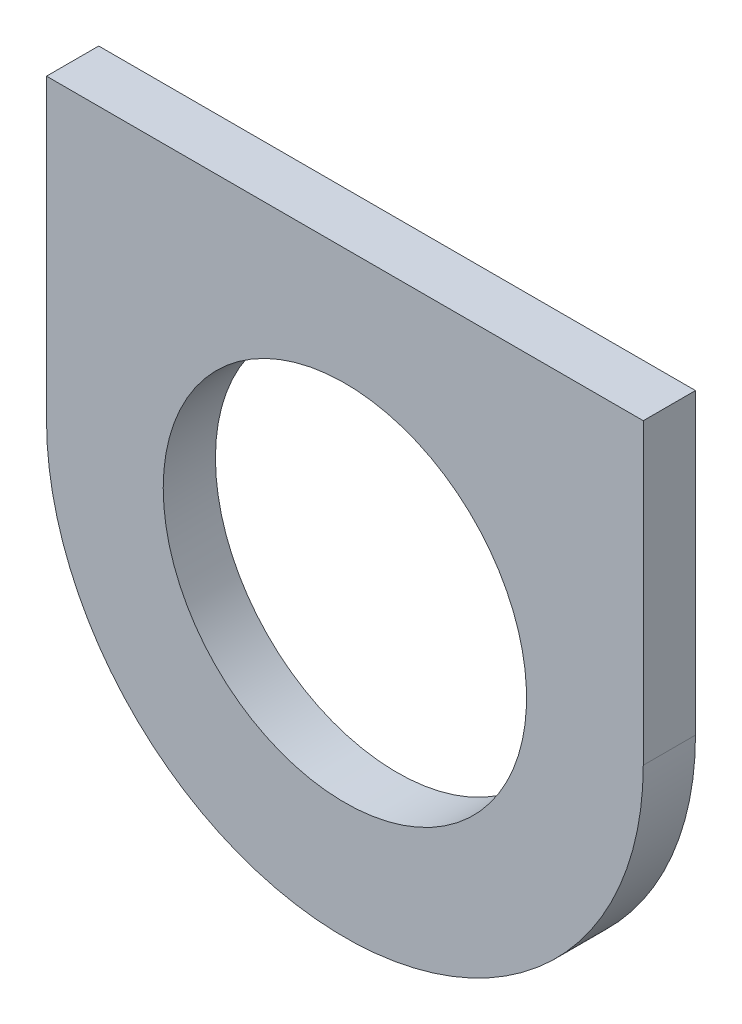
ISO-10303-21;
HEADER;
FILE_DESCRIPTION(('STEP AP214'),'2;1');
FILE_NAME('part.step','',(''),(''),'','','');
FILE_SCHEMA(('AUTOMOTIVE_DESIGN { 1 0 10303 214 1 1 1 1 }'));
ENDSEC;
DATA;
#1=APPLICATION_CONTEXT('core data for automotive mechanical design processes');
#2=APPLICATION_PROTOCOL_DEFINITION('international standard','automotive_design',2000,#1);
#3=PRODUCT_CONTEXT('',#1,'mechanical');
#4=PRODUCT('Part','Part','',(#3));
#5=PRODUCT_RELATED_PRODUCT_CATEGORY('part','',(#4));
#6=PRODUCT_DEFINITION_FORMATION('','',#4);
#7=PRODUCT_DEFINITION_CONTEXT('part definition',#1,'design');
#8=PRODUCT_DEFINITION('design','',#6,#7);
#9=PRODUCT_DEFINITION_SHAPE('','',#8);
#10=(LENGTH_UNIT() NAMED_UNIT(*) SI_UNIT(.MILLI.,.METRE.));
#11=(NAMED_UNIT(*) PLANE_ANGLE_UNIT() SI_UNIT($,.RADIAN.));
#12=(NAMED_UNIT(*) SI_UNIT($,.STERADIAN.) SOLID_ANGLE_UNIT());
#13=UNCERTAINTY_MEASURE_WITH_UNIT(LENGTH_MEASURE(1.E-05),#10,'distance_accuracy_value','');
#14=(GEOMETRIC_REPRESENTATION_CONTEXT(3) GLOBAL_UNCERTAINTY_ASSIGNED_CONTEXT((#13)) GLOBAL_UNIT_ASSIGNED_CONTEXT((#10,
#11,#12)) REPRESENTATION_CONTEXT('',''));
#15=CARTESIAN_POINT('',(0.,0.,0.));
#16=DIRECTION('',(0.,0.,1.));
#17=DIRECTION('',(1.,0.,0.));
#18=AXIS2_PLACEMENT_3D('',#15,#16,#17);
#19=CARTESIAN_POINT('',(-111.06193771337,637.468625118651,763.667404568447));
#20=DIRECTION('',(0.,0.,-1.));
#21=DIRECTION('',(-1.,0.,0.));
#22=AXIS2_PLACEMENT_3D('',#19,#20,#21);
#23=PLANE('',#22);
#24=CARTESIAN_POINT('',(-111.06193771337,637.468625118651,763.667404568447));
#25=DIRECTION('',(0.,0.,-1.));
#26=DIRECTION('',(-1.,0.,0.));
#27=AXIS2_PLACEMENT_3D('',#24,#25,#26);
#28=CIRCLE('',#27,2.85749999999998);
#29=CARTESIAN_POINT('',(-108.20443771337,637.468625118651,763.667404568447));
#30=VERTEX_POINT('',#29);
#31=CARTESIAN_POINT('',(-113.91943771337,637.468625118651,763.667404568447));
#32=VERTEX_POINT('',#31);
#33=EDGE_CURVE('E86',#30,#32,#28,.T.);
#34=ORIENTED_EDGE('',*,*,#33,.T.);
#35=DIRECTION('',(0.,1.,0.));
#36=VECTOR('',#35,1.);
#37=CARTESIAN_POINT('',(-113.91943771337,637.468625118651,763.667404568447));
#38=LINE('',#37,#36);
#39=CARTESIAN_POINT('',(-113.91943771337,640.326125118651,763.667404568447));
#40=VERTEX_POINT('',#39);
#41=EDGE_CURVE('E81',#32,#40,#38,.T.);
#42=ORIENTED_EDGE('',*,*,#41,.T.);
#43=DIRECTION('',(1.,0.,0.));
#44=VECTOR('',#43,1.);
#45=CARTESIAN_POINT('',(-111.06193771337,640.326125118651,763.667404568447));
#46=LINE('',#45,#44);
#47=CARTESIAN_POINT('',(-108.20443771337,640.326125118651,763.667404568447));
#48=VERTEX_POINT('',#47);
#49=EDGE_CURVE('E84',#40,#48,#46,.T.);
#50=ORIENTED_EDGE('',*,*,#49,.T.);
#51=DIRECTION('',(0.,-1.,0.));
#52=VECTOR('',#51,1.);
#53=CARTESIAN_POINT('',(-108.20443771337,637.468625118651,763.667404568447));
#54=LINE('',#53,#52);
#55=EDGE_CURVE('E52',#48,#30,#54,.T.);
#56=ORIENTED_EDGE('',*,*,#55,.T.);
#57=EDGE_LOOP('',(#34,#42,#50,#56));
#58=FACE_BOUND('',#57,.T.);
#59=CARTESIAN_POINT('',(-111.06193771337,637.468625118651,763.667404568447));
#60=DIRECTION('',(0.,0.,-1.));
#61=DIRECTION('',(-1.,0.,0.));
#62=AXIS2_PLACEMENT_3D('',#59,#60,#61);
#63=CIRCLE('',#62,1.73990000000006);
#64=CARTESIAN_POINT('',(-112.80183771337,637.468625118651,763.667404568447));
#65=VERTEX_POINT('',#64);
#66=EDGE_CURVE('E102',#65,#65,#63,.T.);
#67=ORIENTED_EDGE('',*,*,#66,.F.);
#68=EDGE_LOOP('',(#67));
#69=FACE_BOUND('',#68,.T.);
#70=ADVANCED_FACE('F35',(#58,#69),#23,.T.);
#71=CARTESIAN_POINT('',(-111.06193771337,637.468625118651,764.167404568447));
#72=DIRECTION('',(0.,0.,-1.));
#73=DIRECTION('',(-1.,0.,0.));
#74=AXIS2_PLACEMENT_3D('',#71,#72,#73);
#75=PLANE('',#74);
#76=CARTESIAN_POINT('',(-111.06193771337,637.468625118651,764.167404568447));
#77=DIRECTION('',(0.,0.,-1.));
#78=DIRECTION('',(-1.,0.,0.));
#79=AXIS2_PLACEMENT_3D('',#76,#77,#78);
#80=CIRCLE('',#79,2.85749999999998);
#81=CARTESIAN_POINT('',(-108.20443771337,637.468625118651,764.167404568447));
#82=VERTEX_POINT('',#81);
#83=CARTESIAN_POINT('',(-113.91943771337,637.468625118651,764.167404568447));
#84=VERTEX_POINT('',#83);
#85=EDGE_CURVE('E99',#82,#84,#80,.T.);
#86=ORIENTED_EDGE('',*,*,#85,.F.);
#87=DIRECTION('',(0.,-1.,0.));
#88=VECTOR('',#87,1.);
#89=CARTESIAN_POINT('',(-108.20443771337,637.468625118651,764.167404568447));
#90=LINE('',#89,#88);
#91=CARTESIAN_POINT('',(-108.20443771337,640.326125118651,764.167404568447));
#92=VERTEX_POINT('',#91);
#93=EDGE_CURVE('E74',#92,#82,#90,.T.);
#94=ORIENTED_EDGE('',*,*,#93,.F.);
#95=DIRECTION('',(1.,0.,0.));
#96=VECTOR('',#95,1.);
#97=CARTESIAN_POINT('',(-111.06193771337,640.326125118651,764.167404568447));
#98=LINE('',#97,#96);
#99=CARTESIAN_POINT('',(-113.91943771337,640.326125118651,764.167404568447));
#100=VERTEX_POINT('',#99);
#101=EDGE_CURVE('E68',#100,#92,#98,.T.);
#102=ORIENTED_EDGE('',*,*,#101,.F.);
#103=DIRECTION('',(0.,1.,0.));
#104=VECTOR('',#103,1.);
#105=CARTESIAN_POINT('',(-113.91943771337,637.468625118651,764.167404568447));
#106=LINE('',#105,#104);
#107=EDGE_CURVE('E91',#84,#100,#106,.T.);
#108=ORIENTED_EDGE('',*,*,#107,.F.);
#109=EDGE_LOOP('',(#86,#94,#102,#108));
#110=FACE_BOUND('',#109,.T.);
#111=CARTESIAN_POINT('',(-111.06193771337,637.468625118651,764.167404568447));
#112=DIRECTION('',(0.,0.,-1.));
#113=DIRECTION('',(-1.,0.,0.));
#114=AXIS2_PLACEMENT_3D('',#111,#112,#113);
#115=CIRCLE('',#114,1.73990000000006);
#116=CARTESIAN_POINT('',(-112.80183771337,637.468625118651,764.167404568447));
#117=VERTEX_POINT('',#116);
#118=EDGE_CURVE('E114',#117,#117,#115,.T.);
#119=ORIENTED_EDGE('',*,*,#118,.T.);
#120=EDGE_LOOP('',(#119));
#121=FACE_BOUND('',#120,.T.);
#122=ADVANCED_FACE('F110',(#110,#121),#75,.F.);
#123=CARTESIAN_POINT('',(-111.06193771337,637.468625118651,763.667404568447));
#124=DIRECTION('',(0.,0.,1.));
#125=DIRECTION('',(1.,0.,0.));
#126=AXIS2_PLACEMENT_3D('',#123,#124,#125);
#127=CYLINDRICAL_SURFACE('',#126,2.85749999999998);
#128=ORIENTED_EDGE('',*,*,#85,.T.);
#129=DIRECTION('',(0.,0.,1.));
#130=VECTOR('',#129,1.);
#131=CARTESIAN_POINT('',(-113.91943771337,637.468625118651,763.667404568447));
#132=LINE('',#131,#130);
#133=EDGE_CURVE('E11',#32,#84,#132,.T.);
#134=ORIENTED_EDGE('',*,*,#133,.F.);
#135=ORIENTED_EDGE('',*,*,#33,.F.);
#136=DIRECTION('',(0.,0.,1.));
#137=VECTOR('',#136,1.);
#138=CARTESIAN_POINT('',(-108.20443771337,637.468625118651,763.667404568447));
#139=LINE('',#138,#137);
#140=EDGE_CURVE('E95',#30,#82,#139,.T.);
#141=ORIENTED_EDGE('',*,*,#140,.T.);
#142=EDGE_LOOP('',(#128,#134,#135,#141));
#143=FACE_BOUND('',#142,.T.);
#144=ADVANCED_FACE('F37',(#143),#127,.T.);
#145=CARTESIAN_POINT('',(-113.91943771337,637.468625118651,763.667404568447));
#146=DIRECTION('',(1.,0.,0.));
#147=DIRECTION('',(0.,0.,-1.));
#148=AXIS2_PLACEMENT_3D('',#145,#146,#147);
#149=PLANE('',#148);
#150=ORIENTED_EDGE('',*,*,#107,.T.);
#151=DIRECTION('',(0.,0.,1.));
#152=VECTOR('',#151,1.);
#153=CARTESIAN_POINT('',(-113.91943771337,640.326125118651,763.667404568447));
#154=LINE('',#153,#152);
#155=EDGE_CURVE('E44',#40,#100,#154,.T.);
#156=ORIENTED_EDGE('',*,*,#155,.F.);
#157=ORIENTED_EDGE('',*,*,#41,.F.);
#158=ORIENTED_EDGE('',*,*,#133,.T.);
#159=EDGE_LOOP('',(#150,#156,#157,#158));
#160=FACE_BOUND('',#159,.T.);
#161=ADVANCED_FACE('F90',(#160),#149,.F.);
#162=CARTESIAN_POINT('',(-111.06193771337,640.326125118651,763.667404568447));
#163=DIRECTION('',(0.,-1.,0.));
#164=DIRECTION('',(0.,0.,-1.));
#165=AXIS2_PLACEMENT_3D('',#162,#163,#164);
#166=PLANE('',#165);
#167=ORIENTED_EDGE('',*,*,#101,.T.);
#168=DIRECTION('',(0.,0.,1.));
#169=VECTOR('',#168,1.);
#170=CARTESIAN_POINT('',(-108.20443771337,640.326125118651,763.667404568447));
#171=LINE('',#170,#169);
#172=EDGE_CURVE('E92',#48,#92,#171,.T.);
#173=ORIENTED_EDGE('',*,*,#172,.F.);
#174=ORIENTED_EDGE('',*,*,#49,.F.);
#175=ORIENTED_EDGE('',*,*,#155,.T.);
#176=EDGE_LOOP('',(#167,#173,#174,#175));
#177=FACE_BOUND('',#176,.T.);
#178=ADVANCED_FACE('F93',(#177),#166,.F.);
#179=CARTESIAN_POINT('',(-108.20443771337,637.468625118651,763.667404568447));
#180=DIRECTION('',(-1.,0.,0.));
#181=DIRECTION('',(0.,-1.,0.));
#182=AXIS2_PLACEMENT_3D('',#179,#180,#181);
#183=PLANE('',#182);
#184=ORIENTED_EDGE('',*,*,#93,.T.);
#185=ORIENTED_EDGE('',*,*,#140,.F.);
#186=ORIENTED_EDGE('',*,*,#55,.F.);
#187=ORIENTED_EDGE('',*,*,#172,.T.);
#188=EDGE_LOOP('',(#184,#185,#186,#187));
#189=FACE_BOUND('',#188,.T.);
#190=ADVANCED_FACE('F107',(#189),#183,.F.);
#191=CARTESIAN_POINT('',(-111.06193771337,637.468625118651,763.667404568447));
#192=DIRECTION('',(0.,0.,1.));
#193=DIRECTION('',(1.,0.,0.));
#194=AXIS2_PLACEMENT_3D('',#191,#192,#193);
#195=CYLINDRICAL_SURFACE('',#194,1.73990000000006);
#196=ORIENTED_EDGE('',*,*,#66,.T.);
#197=EDGE_LOOP('',(#196));
#198=FACE_BOUND('',#197,.T.);
#199=ORIENTED_EDGE('',*,*,#118,.F.);
#200=EDGE_LOOP('',(#199));
#201=FACE_BOUND('',#200,.T.);
#202=ADVANCED_FACE('F120',(#198,#201),#195,.F.);
#203=CLOSED_SHELL('',(#70,#122,#144,#161,#178,#190,#202));
#204=MANIFOLD_SOLID_BREP('B2',#203);
#205=ADVANCED_BREP_SHAPE_REPRESENTATION('',(#18,#204),#14);
#206=SHAPE_DEFINITION_REPRESENTATION(#9,#205);
ENDSEC;
END-ISO-10303-21;
